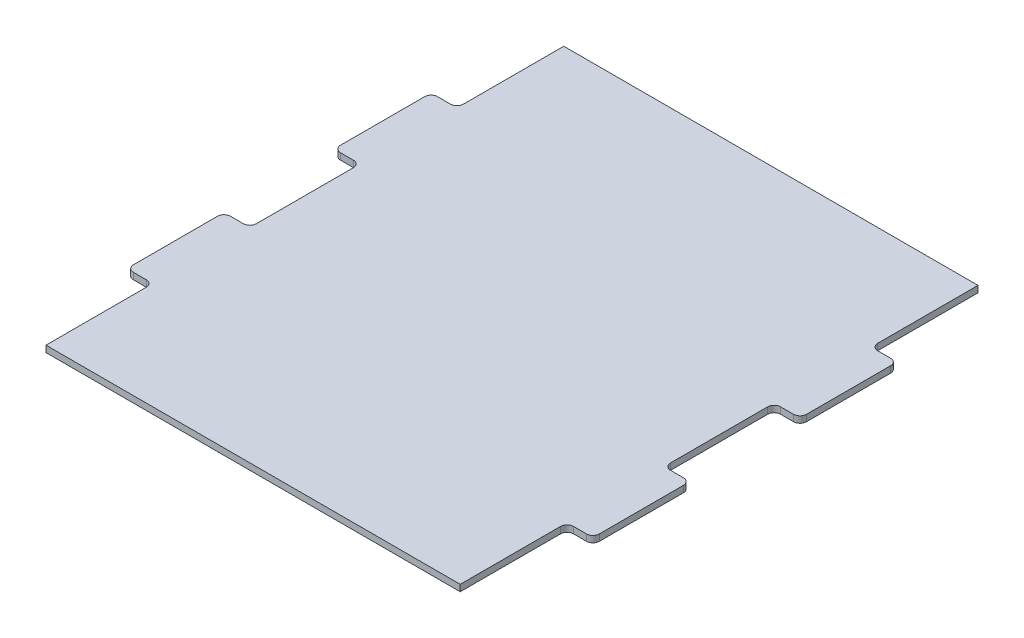
ISO-10303-21;
HEADER;
FILE_DESCRIPTION(('STEP AP214'),'2;1');
FILE_NAME('part.step','',(''),(''),'','','');
FILE_SCHEMA(('AUTOMOTIVE_DESIGN { 1 0 10303 214 1 1 1 1 }'));
ENDSEC;
DATA;
#1=APPLICATION_CONTEXT('core data for automotive mechanical design processes');
#2=APPLICATION_PROTOCOL_DEFINITION('international standard','automotive_design',2000,#1);
#3=PRODUCT_CONTEXT('',#1,'mechanical');
#4=PRODUCT('Part','Part','',(#3));
#5=PRODUCT_RELATED_PRODUCT_CATEGORY('part','',(#4));
#6=PRODUCT_DEFINITION_FORMATION('','',#4);
#7=PRODUCT_DEFINITION_CONTEXT('part definition',#1,'design');
#8=PRODUCT_DEFINITION('design','',#6,#7);
#9=PRODUCT_DEFINITION_SHAPE('','',#8);
#10=(LENGTH_UNIT() NAMED_UNIT(*) SI_UNIT(.MILLI.,.METRE.));
#11=(NAMED_UNIT(*) PLANE_ANGLE_UNIT() SI_UNIT($,.RADIAN.));
#12=(NAMED_UNIT(*) SI_UNIT($,.STERADIAN.) SOLID_ANGLE_UNIT());
#13=UNCERTAINTY_MEASURE_WITH_UNIT(LENGTH_MEASURE(1.E-05),#10,'distance_accuracy_value','');
#14=(GEOMETRIC_REPRESENTATION_CONTEXT(3) GLOBAL_UNCERTAINTY_ASSIGNED_CONTEXT((#13)) GLOBAL_UNIT_ASSIGNED_CONTEXT((#10,
#11,#12)) REPRESENTATION_CONTEXT('',''));
#15=CARTESIAN_POINT('',(0.,0.,0.));
#16=DIRECTION('',(0.,0.,1.));
#17=DIRECTION('',(1.,0.,0.));
#18=AXIS2_PLACEMENT_3D('',#15,#16,#17);
#19=CARTESIAN_POINT('',(0.,3.175,0.));
#20=DIRECTION('',(1.,0.,0.));
#21=DIRECTION('',(0.,0.,-1.));
#22=AXIS2_PLACEMENT_3D('',#19,#20,#21);
#23=PLANE('',#22);
#24=DIRECTION('',(0.,0.,1.));
#25=VECTOR('',#24,1.);
#26=CARTESIAN_POINT('',(0.,3.175,0.));
#27=LINE('',#26,#25);
#28=CARTESIAN_POINT('',(0.,3.175,204.7875));
#29=VERTEX_POINT('',#28);
#30=CARTESIAN_POINT('',(0.,3.175,254.));
#31=VERTEX_POINT('',#30);
#32=EDGE_CURVE('E283',#29,#31,#27,.T.);
#33=ORIENTED_EDGE('',*,*,#32,.F.);
#34=DIRECTION('',(0.,-1.,0.));
#35=VECTOR('',#34,1.);
#36=CARTESIAN_POINT('',(0.,3.175,204.7875));
#37=LINE('',#36,#35);
#38=CARTESIAN_POINT('',(0.,0.,204.7875));
#39=VERTEX_POINT('',#38);
#40=EDGE_CURVE('E375',#29,#39,#37,.T.);
#41=ORIENTED_EDGE('',*,*,#40,.T.);
#42=DIRECTION('',(0.,0.,1.));
#43=VECTOR('',#42,1.);
#44=CARTESIAN_POINT('',(0.,0.,0.));
#45=LINE('',#44,#43);
#46=CARTESIAN_POINT('',(0.,0.,254.));
#47=VERTEX_POINT('',#46);
#48=EDGE_CURVE('E461',#39,#47,#45,.T.);
#49=ORIENTED_EDGE('',*,*,#48,.T.);
#50=DIRECTION('',(0.,-1.,0.));
#51=VECTOR('',#50,1.);
#52=CARTESIAN_POINT('',(0.,3.175,254.));
#53=LINE('',#52,#51);
#54=EDGE_CURVE('E299',#31,#47,#53,.T.);
#55=ORIENTED_EDGE('',*,*,#54,.F.);
#56=EDGE_LOOP('',(#33,#41,#49,#55));
#57=FACE_BOUND('',#56,.T.);
#58=ADVANCED_FACE('F35',(#57),#23,.F.);
#59=CARTESIAN_POINT('',(203.2,3.175,254.));
#60=DIRECTION('',(-1.,0.,0.));
#61=DIRECTION('',(0.,0.,1.));
#62=AXIS2_PLACEMENT_3D('',#59,#60,#61);
#63=PLANE('',#62);
#64=DIRECTION('',(0.,0.,-1.));
#65=VECTOR('',#64,1.);
#66=CARTESIAN_POINT('',(203.2,0.,254.));
#67=LINE('',#66,#65);
#68=CARTESIAN_POINT('',(203.2,0.,254.));
#69=VERTEX_POINT('',#68);
#70=CARTESIAN_POINT('',(203.2,0.,204.7875));
#71=VERTEX_POINT('',#70);
#72=EDGE_CURVE('E293',#69,#71,#67,.T.);
#73=ORIENTED_EDGE('',*,*,#72,.T.);
#74=DIRECTION('',(0.,1.,0.));
#75=VECTOR('',#74,1.);
#76=CARTESIAN_POINT('',(203.2,3.175,204.7875));
#77=LINE('',#76,#75);
#78=CARTESIAN_POINT('',(203.2,3.175,204.7875));
#79=VERTEX_POINT('',#78);
#80=EDGE_CURVE('E298',#71,#79,#77,.T.);
#81=ORIENTED_EDGE('',*,*,#80,.T.);
#82=DIRECTION('',(0.,0.,-1.));
#83=VECTOR('',#82,1.);
#84=CARTESIAN_POINT('',(203.2,3.175,254.));
#85=LINE('',#84,#83);
#86=CARTESIAN_POINT('',(203.2,3.175,254.));
#87=VERTEX_POINT('',#86);
#88=EDGE_CURVE('E474',#87,#79,#85,.T.);
#89=ORIENTED_EDGE('',*,*,#88,.F.);
#90=DIRECTION('',(0.,-1.,0.));
#91=VECTOR('',#90,1.);
#92=CARTESIAN_POINT('',(203.2,3.175,254.));
#93=LINE('',#92,#91);
#94=EDGE_CURVE('E305',#87,#69,#93,.T.);
#95=ORIENTED_EDGE('',*,*,#94,.T.);
#96=EDGE_LOOP('',(#73,#81,#89,#95));
#97=FACE_BOUND('',#96,.T.);
#98=ADVANCED_FACE('F590',(#97),#63,.F.);
#99=CARTESIAN_POINT('',(0.,0.,103.1875));
#100=VERTEX_POINT('',#99);
#101=CARTESIAN_POINT('',(0.,0.,150.8125));
#102=VERTEX_POINT('',#101);
#103=EDGE_CURVE('E459',#100,#102,#45,.T.);
#104=ORIENTED_EDGE('',*,*,#103,.T.);
#105=DIRECTION('',(0.,1.,0.));
#106=VECTOR('',#105,1.);
#107=CARTESIAN_POINT('',(0.,3.175,150.8125));
#108=LINE('',#107,#106);
#109=CARTESIAN_POINT('',(0.,3.175,150.8125));
#110=VERTEX_POINT('',#109);
#111=EDGE_CURVE('E390',#102,#110,#108,.T.);
#112=ORIENTED_EDGE('',*,*,#111,.T.);
#113=CARTESIAN_POINT('',(0.,3.175,103.1875));
#114=VERTEX_POINT('',#113);
#115=EDGE_CURVE('E281',#114,#110,#27,.T.);
#116=ORIENTED_EDGE('',*,*,#115,.F.);
#117=DIRECTION('',(0.,-1.,0.));
#118=VECTOR('',#117,1.);
#119=CARTESIAN_POINT('',(0.,3.175,103.1875));
#120=LINE('',#119,#118);
#121=EDGE_CURVE('E387',#114,#100,#120,.T.);
#122=ORIENTED_EDGE('',*,*,#121,.T.);
#123=EDGE_LOOP('',(#104,#112,#116,#122));
#124=FACE_BOUND('',#123,.T.);
#125=ADVANCED_FACE('F617',(#124),#23,.F.);
#126=CARTESIAN_POINT('',(203.2,3.175,150.8125));
#127=VERTEX_POINT('',#126);
#128=CARTESIAN_POINT('',(203.2,3.175,103.1875));
#129=VERTEX_POINT('',#128);
#130=EDGE_CURVE('E478',#127,#129,#85,.T.);
#131=ORIENTED_EDGE('',*,*,#130,.F.);
#132=DIRECTION('',(0.,-1.,0.));
#133=VECTOR('',#132,1.);
#134=CARTESIAN_POINT('',(203.2,3.175,150.8125));
#135=LINE('',#134,#133);
#136=CARTESIAN_POINT('',(203.2,0.,150.8125));
#137=VERTEX_POINT('',#136);
#138=EDGE_CURVE('E356',#127,#137,#135,.T.);
#139=ORIENTED_EDGE('',*,*,#138,.T.);
#140=CARTESIAN_POINT('',(203.2,0.,103.1875));
#141=VERTEX_POINT('',#140);
#142=EDGE_CURVE('E552',#137,#141,#67,.T.);
#143=ORIENTED_EDGE('',*,*,#142,.T.);
#144=DIRECTION('',(0.,1.,0.));
#145=VECTOR('',#144,1.);
#146=CARTESIAN_POINT('',(203.2,3.175,103.1875));
#147=LINE('',#146,#145);
#148=EDGE_CURVE('E353',#141,#129,#147,.T.);
#149=ORIENTED_EDGE('',*,*,#148,.T.);
#150=EDGE_LOOP('',(#131,#139,#143,#149));
#151=FACE_BOUND('',#150,.T.);
#152=ADVANCED_FACE('F548',(#151),#63,.F.);
#153=CARTESIAN_POINT('',(203.2,3.175,0.));
#154=DIRECTION('',(0.,0.,1.));
#155=DIRECTION('',(1.,0.,0.));
#156=AXIS2_PLACEMENT_3D('',#153,#154,#155);
#157=PLANE('',#156);
#158=DIRECTION('',(-1.,0.,0.));
#159=VECTOR('',#158,1.);
#160=CARTESIAN_POINT('',(203.2,0.,0.));
#161=LINE('',#160,#159);
#162=CARTESIAN_POINT('',(203.2,0.,0.));
#163=VERTEX_POINT('',#162);
#164=CARTESIAN_POINT('',(0.,0.,0.));
#165=VERTEX_POINT('',#164);
#166=EDGE_CURVE('E297',#163,#165,#161,.T.);
#167=ORIENTED_EDGE('',*,*,#166,.T.);
#168=DIRECTION('',(0.,-1.,0.));
#169=VECTOR('',#168,1.);
#170=CARTESIAN_POINT('',(0.,3.175,0.));
#171=LINE('',#170,#169);
#172=CARTESIAN_POINT('',(0.,3.175,0.));
#173=VERTEX_POINT('',#172);
#174=EDGE_CURVE('E275',#173,#165,#171,.T.);
#175=ORIENTED_EDGE('',*,*,#174,.F.);
#176=DIRECTION('',(-1.,0.,0.));
#177=VECTOR('',#176,1.);
#178=CARTESIAN_POINT('',(203.2,3.175,0.));
#179=LINE('',#178,#177);
#180=CARTESIAN_POINT('',(203.2,3.175,0.));
#181=VERTEX_POINT('',#180);
#182=EDGE_CURVE('E285',#181,#173,#179,.T.);
#183=ORIENTED_EDGE('',*,*,#182,.F.);
#184=DIRECTION('',(0.,-1.,0.));
#185=VECTOR('',#184,1.);
#186=CARTESIAN_POINT('',(203.2,3.175,0.));
#187=LINE('',#186,#185);
#188=EDGE_CURVE('E477',#181,#163,#187,.T.);
#189=ORIENTED_EDGE('',*,*,#188,.T.);
#190=EDGE_LOOP('',(#167,#175,#183,#189));
#191=FACE_BOUND('',#190,.T.);
#192=ADVANCED_FACE('F295',(#191),#157,.F.);
#193=CARTESIAN_POINT('',(0.,0.,49.2125));
#194=VERTEX_POINT('',#193);
#195=EDGE_CURVE('E456',#165,#194,#45,.T.);
#196=ORIENTED_EDGE('',*,*,#195,.T.);
#197=DIRECTION('',(0.,1.,0.));
#198=VECTOR('',#197,1.);
#199=CARTESIAN_POINT('',(0.,3.175,49.2125));
#200=LINE('',#199,#198);
#201=CARTESIAN_POINT('',(0.,3.175,49.2125));
#202=VERTEX_POINT('',#201);
#203=EDGE_CURVE('E278',#194,#202,#200,.T.);
#204=ORIENTED_EDGE('',*,*,#203,.T.);
#205=EDGE_CURVE('E270',#173,#202,#27,.T.);
#206=ORIENTED_EDGE('',*,*,#205,.F.);
#207=ORIENTED_EDGE('',*,*,#174,.T.);
#208=EDGE_LOOP('',(#196,#204,#206,#207));
#209=FACE_BOUND('',#208,.T.);
#210=ADVANCED_FACE('F273',(#209),#23,.F.);
#211=CARTESIAN_POINT('',(0.,3.175,254.));
#212=DIRECTION('',(0.,0.,-1.));
#213=DIRECTION('',(-1.,0.,0.));
#214=AXIS2_PLACEMENT_3D('',#211,#212,#213);
#215=PLANE('',#214);
#216=DIRECTION('',(1.,0.,0.));
#217=VECTOR('',#216,1.);
#218=CARTESIAN_POINT('',(0.,0.,254.));
#219=LINE('',#218,#217);
#220=EDGE_CURVE('E458',#47,#69,#219,.T.);
#221=ORIENTED_EDGE('',*,*,#220,.T.);
#222=ORIENTED_EDGE('',*,*,#94,.F.);
#223=DIRECTION('',(1.,0.,0.));
#224=VECTOR('',#223,1.);
#225=CARTESIAN_POINT('',(0.,3.175,254.));
#226=LINE('',#225,#224);
#227=EDGE_CURVE('E280',#31,#87,#226,.T.);
#228=ORIENTED_EDGE('',*,*,#227,.F.);
#229=ORIENTED_EDGE('',*,*,#54,.T.);
#230=EDGE_LOOP('',(#221,#222,#228,#229));
#231=FACE_BOUND('',#230,.T.);
#232=ADVANCED_FACE('F628',(#231),#215,.F.);
#233=CARTESIAN_POINT('',(203.2,3.175,49.2125));
#234=VERTEX_POINT('',#233);
#235=EDGE_CURVE('E289',#234,#181,#85,.T.);
#236=ORIENTED_EDGE('',*,*,#235,.F.);
#237=DIRECTION('',(0.,-1.,0.));
#238=VECTOR('',#237,1.);
#239=CARTESIAN_POINT('',(203.2,3.175,49.2125));
#240=LINE('',#239,#238);
#241=CARTESIAN_POINT('',(203.2,0.,49.2125));
#242=VERTEX_POINT('',#241);
#243=EDGE_CURVE('E372',#234,#242,#240,.T.);
#244=ORIENTED_EDGE('',*,*,#243,.T.);
#245=EDGE_CURVE('E462',#242,#163,#67,.T.);
#246=ORIENTED_EDGE('',*,*,#245,.T.);
#247=ORIENTED_EDGE('',*,*,#188,.F.);
#248=EDGE_LOOP('',(#236,#244,#246,#247));
#249=FACE_BOUND('',#248,.T.);
#250=ADVANCED_FACE('F581',(#249),#63,.F.);
#251=CARTESIAN_POINT('',(0.,3.175,0.));
#252=DIRECTION('',(0.,1.,0.));
#253=DIRECTION('',(0.,0.,1.));
#254=AXIS2_PLACEMENT_3D('',#251,#252,#253);
#255=PLANE('',#254);
#256=DIRECTION('',(1.,0.,0.));
#257=VECTOR('',#256,1.);
#258=CARTESIAN_POINT('',(-12.7,3.175,201.6125));
#259=LINE('',#258,#257);
#260=CARTESIAN_POINT('',(206.375,3.175,201.6125));
#261=VERTEX_POINT('',#260);
#262=CARTESIAN_POINT('',(212.725,3.175,201.6125));
#263=VERTEX_POINT('',#262);
#264=EDGE_CURVE('E503',#261,#263,#259,.T.);
#265=ORIENTED_EDGE('',*,*,#264,.T.);
#266=CARTESIAN_POINT('',(212.725,3.175,198.4375));
#267=DIRECTION('',(0.,1.,0.));
#268=DIRECTION('',(0.,0.,1.));
#269=AXIS2_PLACEMENT_3D('',#266,#267,#268);
#270=CIRCLE('',#269,3.175);
#271=CARTESIAN_POINT('',(215.9,3.175,198.4375));
#272=VERTEX_POINT('',#271);
#273=EDGE_CURVE('E327',#263,#272,#270,.T.);
#274=ORIENTED_EDGE('',*,*,#273,.T.);
#275=DIRECTION('',(0.,0.,-1.));
#276=VECTOR('',#275,1.);
#277=CARTESIAN_POINT('',(215.9,3.175,201.6125));
#278=LINE('',#277,#276);
#279=CARTESIAN_POINT('',(215.9,3.175,157.1625));
#280=VERTEX_POINT('',#279);
#281=EDGE_CURVE('E511',#272,#280,#278,.T.);
#282=ORIENTED_EDGE('',*,*,#281,.T.);
#283=CARTESIAN_POINT('',(212.725,3.175,157.1625));
#284=DIRECTION('',(0.,1.,0.));
#285=DIRECTION('',(0.,0.,1.));
#286=AXIS2_PLACEMENT_3D('',#283,#284,#285);
#287=CIRCLE('',#286,3.175);
#288=CARTESIAN_POINT('',(212.725,3.175,153.9875));
#289=VERTEX_POINT('',#288);
#290=EDGE_CURVE('E325',#280,#289,#287,.T.);
#291=ORIENTED_EDGE('',*,*,#290,.T.);
#292=DIRECTION('',(-1.,0.,0.));
#293=VECTOR('',#292,1.);
#294=CARTESIAN_POINT('',(-12.7,3.175,153.9875));
#295=LINE('',#294,#293);
#296=CARTESIAN_POINT('',(206.375,3.175,153.9875));
#297=VERTEX_POINT('',#296);
#298=EDGE_CURVE('E507',#289,#297,#295,.T.);
#299=ORIENTED_EDGE('',*,*,#298,.T.);
#300=CARTESIAN_POINT('',(206.375,3.175,150.8125));
#301=DIRECTION('',(0.,1.,0.));
#302=DIRECTION('',(0.,0.,1.));
#303=AXIS2_PLACEMENT_3D('',#300,#301,#302);
#304=CIRCLE('',#303,3.175);
#305=EDGE_CURVE('E419',#297,#127,#304,.F.);
#306=ORIENTED_EDGE('',*,*,#305,.T.);
#307=ORIENTED_EDGE('',*,*,#130,.T.);
#308=CARTESIAN_POINT('',(206.375,3.175,103.1875));
#309=DIRECTION('',(0.,1.,0.));
#310=DIRECTION('',(0.,0.,1.));
#311=AXIS2_PLACEMENT_3D('',#308,#309,#310);
#312=CIRCLE('',#311,3.175);
#313=CARTESIAN_POINT('',(206.375,3.175,100.0125));
#314=VERTEX_POINT('',#313);
#315=EDGE_CURVE('E421',#129,#314,#312,.F.);
#316=ORIENTED_EDGE('',*,*,#315,.T.);
#317=DIRECTION('',(1.,0.,0.));
#318=VECTOR('',#317,1.);
#319=CARTESIAN_POINT('',(-12.7,3.175,100.0125));
#320=LINE('',#319,#318);
#321=CARTESIAN_POINT('',(212.725,3.175,100.0125));
#322=VERTEX_POINT('',#321);
#323=EDGE_CURVE('E484',#314,#322,#320,.T.);
#324=ORIENTED_EDGE('',*,*,#323,.T.);
#325=CARTESIAN_POINT('',(212.725,3.175,96.8375));
#326=DIRECTION('',(0.,1.,0.));
#327=DIRECTION('',(0.,0.,1.));
#328=AXIS2_PLACEMENT_3D('',#325,#326,#327);
#329=CIRCLE('',#328,3.175);
#330=CARTESIAN_POINT('',(215.9,3.175,96.8375));
#331=VERTEX_POINT('',#330);
#332=EDGE_CURVE('E323',#322,#331,#329,.T.);
#333=ORIENTED_EDGE('',*,*,#332,.T.);
#334=DIRECTION('',(0.,0.,-1.));
#335=VECTOR('',#334,1.);
#336=CARTESIAN_POINT('',(215.9,3.175,100.0125));
#337=LINE('',#336,#335);
#338=CARTESIAN_POINT('',(215.9,3.175,55.5625));
#339=VERTEX_POINT('',#338);
#340=EDGE_CURVE('E451',#331,#339,#337,.T.);
#341=ORIENTED_EDGE('',*,*,#340,.T.);
#342=CARTESIAN_POINT('',(212.725,3.175,55.5625));
#343=DIRECTION('',(0.,1.,0.));
#344=DIRECTION('',(0.,0.,1.));
#345=AXIS2_PLACEMENT_3D('',#342,#343,#344);
#346=CIRCLE('',#345,3.175);
#347=CARTESIAN_POINT('',(212.725,3.175,52.3875));
#348=VERTEX_POINT('',#347);
#349=EDGE_CURVE('E321',#339,#348,#346,.T.);
#350=ORIENTED_EDGE('',*,*,#349,.T.);
#351=DIRECTION('',(-1.,0.,0.));
#352=VECTOR('',#351,1.);
#353=CARTESIAN_POINT('',(-12.7,3.175,52.3875));
#354=LINE('',#353,#352);
#355=CARTESIAN_POINT('',(206.375,3.175,52.3875));
#356=VERTEX_POINT('',#355);
#357=EDGE_CURVE('E450',#348,#356,#354,.T.);
#358=ORIENTED_EDGE('',*,*,#357,.T.);
#359=CARTESIAN_POINT('',(206.375,3.175,49.2125));
#360=DIRECTION('',(0.,1.,0.));
#361=DIRECTION('',(0.,0.,1.));
#362=AXIS2_PLACEMENT_3D('',#359,#360,#361);
#363=CIRCLE('',#362,3.175);
#364=EDGE_CURVE('E427',#356,#234,#363,.F.);
#365=ORIENTED_EDGE('',*,*,#364,.T.);
#366=ORIENTED_EDGE('',*,*,#235,.T.);
#367=ORIENTED_EDGE('',*,*,#182,.T.);
#368=ORIENTED_EDGE('',*,*,#205,.T.);
#369=CARTESIAN_POINT('',(-3.17499999999999,3.175,49.2125));
#370=DIRECTION('',(0.,1.,0.));
#371=DIRECTION('',(0.,0.,1.));
#372=AXIS2_PLACEMENT_3D('',#369,#370,#371);
#373=CIRCLE('',#372,3.175);
#374=CARTESIAN_POINT('',(-3.17499999999999,3.175,52.3875));
#375=VERTEX_POINT('',#374);
#376=EDGE_CURVE('E43',#202,#375,#373,.F.);
#377=ORIENTED_EDGE('',*,*,#376,.T.);
#378=CARTESIAN_POINT('',(-9.52500000000002,3.175,52.3875));
#379=VERTEX_POINT('',#378);
#380=EDGE_CURVE('E442',#375,#379,#354,.T.);
#381=ORIENTED_EDGE('',*,*,#380,.T.);
#382=CARTESIAN_POINT('',(-9.52500000000002,3.175,55.5625));
#383=DIRECTION('',(0.,1.,0.));
#384=DIRECTION('',(0.,0.,1.));
#385=AXIS2_PLACEMENT_3D('',#382,#383,#384);
#386=CIRCLE('',#385,3.175);
#387=CARTESIAN_POINT('',(-12.7,3.175,55.5625));
#388=VERTEX_POINT('',#387);
#389=EDGE_CURVE('E313',#379,#388,#386,.T.);
#390=ORIENTED_EDGE('',*,*,#389,.T.);
#391=DIRECTION('',(0.,0.,1.));
#392=VECTOR('',#391,1.);
#393=CARTESIAN_POINT('',(-12.7,3.175,100.0125));
#394=LINE('',#393,#392);
#395=CARTESIAN_POINT('',(-12.7,3.175,96.8375));
#396=VERTEX_POINT('',#395);
#397=EDGE_CURVE('E485',#388,#396,#394,.T.);
#398=ORIENTED_EDGE('',*,*,#397,.T.);
#399=CARTESIAN_POINT('',(-9.52500000000002,3.175,96.8375));
#400=DIRECTION('',(0.,1.,0.));
#401=DIRECTION('',(0.,0.,1.));
#402=AXIS2_PLACEMENT_3D('',#399,#400,#401);
#403=CIRCLE('',#402,3.175);
#404=CARTESIAN_POINT('',(-9.52500000000002,3.175,100.0125));
#405=VERTEX_POINT('',#404);
#406=EDGE_CURVE('E315',#396,#405,#403,.T.);
#407=ORIENTED_EDGE('',*,*,#406,.T.);
#408=CARTESIAN_POINT('',(-3.17499999999999,3.175,100.0125));
#409=VERTEX_POINT('',#408);
#410=EDGE_CURVE('E480',#405,#409,#320,.T.);
#411=ORIENTED_EDGE('',*,*,#410,.T.);
#412=CARTESIAN_POINT('',(-3.17499999999999,3.175,103.1875));
#413=DIRECTION('',(0.,1.,0.));
#414=DIRECTION('',(0.,0.,1.));
#415=AXIS2_PLACEMENT_3D('',#412,#413,#414);
#416=CIRCLE('',#415,3.175);
#417=EDGE_CURVE('E439',#409,#114,#416,.F.);
#418=ORIENTED_EDGE('',*,*,#417,.T.);
#419=ORIENTED_EDGE('',*,*,#115,.T.);
#420=CARTESIAN_POINT('',(-3.17499999999998,3.175,150.8125));
#421=DIRECTION('',(0.,1.,0.));
#422=DIRECTION('',(0.,0.,1.));
#423=AXIS2_PLACEMENT_3D('',#420,#421,#422);
#424=CIRCLE('',#423,3.175);
#425=CARTESIAN_POINT('',(-3.17499999999998,3.175,153.9875));
#426=VERTEX_POINT('',#425);
#427=EDGE_CURVE('E433',#110,#426,#424,.F.);
#428=ORIENTED_EDGE('',*,*,#427,.T.);
#429=CARTESIAN_POINT('',(-9.525,3.175,153.9875));
#430=VERTEX_POINT('',#429);
#431=EDGE_CURVE('E510',#426,#430,#295,.T.);
#432=ORIENTED_EDGE('',*,*,#431,.T.);
#433=CARTESIAN_POINT('',(-9.525,3.175,157.1625));
#434=DIRECTION('',(0.,1.,0.));
#435=DIRECTION('',(0.,0.,1.));
#436=AXIS2_PLACEMENT_3D('',#433,#434,#435);
#437=CIRCLE('',#436,3.175);
#438=CARTESIAN_POINT('',(-12.7,3.175,157.1625));
#439=VERTEX_POINT('',#438);
#440=EDGE_CURVE('E317',#430,#439,#437,.T.);
#441=ORIENTED_EDGE('',*,*,#440,.T.);
#442=DIRECTION('',(0.,0.,1.));
#443=VECTOR('',#442,1.);
#444=CARTESIAN_POINT('',(-12.7,3.175,201.6125));
#445=LINE('',#444,#443);
#446=CARTESIAN_POINT('',(-12.7,3.175,198.4375));
#447=VERTEX_POINT('',#446);
#448=EDGE_CURVE('E504',#439,#447,#445,.T.);
#449=ORIENTED_EDGE('',*,*,#448,.T.);
#450=CARTESIAN_POINT('',(-9.525,3.175,198.4375));
#451=DIRECTION('',(0.,1.,0.));
#452=DIRECTION('',(0.,0.,1.));
#453=AXIS2_PLACEMENT_3D('',#450,#451,#452);
#454=CIRCLE('',#453,3.175);
#455=CARTESIAN_POINT('',(-9.525,3.175,201.6125));
#456=VERTEX_POINT('',#455);
#457=EDGE_CURVE('E319',#447,#456,#454,.T.);
#458=ORIENTED_EDGE('',*,*,#457,.T.);
#459=CARTESIAN_POINT('',(-3.17499999999997,3.175,201.6125));
#460=VERTEX_POINT('',#459);
#461=EDGE_CURVE('E499',#456,#460,#259,.T.);
#462=ORIENTED_EDGE('',*,*,#461,.T.);
#463=CARTESIAN_POINT('',(-3.17499999999997,3.175,204.7875));
#464=DIRECTION('',(0.,1.,0.));
#465=DIRECTION('',(0.,0.,1.));
#466=AXIS2_PLACEMENT_3D('',#463,#464,#465);
#467=CIRCLE('',#466,3.175);
#468=EDGE_CURVE('E431',#460,#29,#467,.F.);
#469=ORIENTED_EDGE('',*,*,#468,.T.);
#470=ORIENTED_EDGE('',*,*,#32,.T.);
#471=ORIENTED_EDGE('',*,*,#227,.T.);
#472=ORIENTED_EDGE('',*,*,#88,.T.);
#473=CARTESIAN_POINT('',(206.375,3.175,204.7875));
#474=DIRECTION('',(0.,1.,0.));
#475=DIRECTION('',(0.,0.,1.));
#476=AXIS2_PLACEMENT_3D('',#473,#474,#475);
#477=CIRCLE('',#476,3.175);
#478=EDGE_CURVE('E413',#79,#261,#477,.F.);
#479=ORIENTED_EDGE('',*,*,#478,.T.);
#480=EDGE_LOOP('',(#265,#274,#282,#291,#299,#306,#307,#316,#324,#333,#341,#350,#358,#365,#366,
#367,#368,#377,#381,#390,#398,#407,#411,#418,#419,#428,#432,#441,#449,#458,#462,#469,#470,#471,
#472,#479));
#481=FACE_BOUND('',#480,.T.);
#482=ADVANCED_FACE('F287',(#481),#255,.T.);
#483=CARTESIAN_POINT('',(0.,0.,0.));
#484=DIRECTION('',(0.,1.,0.));
#485=DIRECTION('',(0.,0.,1.));
#486=AXIS2_PLACEMENT_3D('',#483,#484,#485);
#487=PLANE('',#486);
#488=DIRECTION('',(0.,0.,-1.));
#489=VECTOR('',#488,1.);
#490=CARTESIAN_POINT('',(215.9,0.,201.6125));
#491=LINE('',#490,#489);
#492=CARTESIAN_POINT('',(215.9,0.,198.4375));
#493=VERTEX_POINT('',#492);
#494=CARTESIAN_POINT('',(215.9,0.,157.1625));
#495=VERTEX_POINT('',#494);
#496=EDGE_CURVE('E502',#493,#495,#491,.T.);
#497=ORIENTED_EDGE('',*,*,#496,.F.);
#498=CARTESIAN_POINT('',(212.725,0.,198.4375));
#499=DIRECTION('',(0.,1.,0.));
#500=DIRECTION('',(0.,0.,1.));
#501=AXIS2_PLACEMENT_3D('',#498,#499,#500);
#502=CIRCLE('',#501,3.175);
#503=CARTESIAN_POINT('',(212.725,0.,201.6125));
#504=VERTEX_POINT('',#503);
#505=EDGE_CURVE('E347',#493,#504,#502,.F.);
#506=ORIENTED_EDGE('',*,*,#505,.T.);
#507=DIRECTION('',(1.,0.,0.));
#508=VECTOR('',#507,1.);
#509=CARTESIAN_POINT('',(-12.7,0.,201.6125));
#510=LINE('',#509,#508);
#511=CARTESIAN_POINT('',(206.375,0.,201.6125));
#512=VERTEX_POINT('',#511);
#513=EDGE_CURVE('E516',#512,#504,#510,.T.);
#514=ORIENTED_EDGE('',*,*,#513,.F.);
#515=CARTESIAN_POINT('',(206.375,0.,204.7875));
#516=DIRECTION('',(0.,1.,0.));
#517=DIRECTION('',(0.,0.,1.));
#518=AXIS2_PLACEMENT_3D('',#515,#516,#517);
#519=CIRCLE('',#518,3.175);
#520=EDGE_CURVE('E415',#512,#71,#519,.T.);
#521=ORIENTED_EDGE('',*,*,#520,.T.);
#522=ORIENTED_EDGE('',*,*,#72,.F.);
#523=ORIENTED_EDGE('',*,*,#220,.F.);
#524=ORIENTED_EDGE('',*,*,#48,.F.);
#525=CARTESIAN_POINT('',(-3.17499999999997,0.,204.7875));
#526=DIRECTION('',(0.,1.,0.));
#527=DIRECTION('',(0.,0.,1.));
#528=AXIS2_PLACEMENT_3D('',#525,#526,#527);
#529=CIRCLE('',#528,3.175);
#530=CARTESIAN_POINT('',(-3.17499999999997,0.,201.6125));
#531=VERTEX_POINT('',#530);
#532=EDGE_CURVE('E429',#39,#531,#529,.T.);
#533=ORIENTED_EDGE('',*,*,#532,.T.);
#534=CARTESIAN_POINT('',(-9.525,0.,201.6125));
#535=VERTEX_POINT('',#534);
#536=EDGE_CURVE('E489',#535,#531,#510,.T.);
#537=ORIENTED_EDGE('',*,*,#536,.F.);
#538=CARTESIAN_POINT('',(-9.525,0.,198.4375));
#539=DIRECTION('',(0.,1.,0.));
#540=DIRECTION('',(0.,0.,1.));
#541=AXIS2_PLACEMENT_3D('',#538,#539,#540);
#542=CIRCLE('',#541,3.175);
#543=CARTESIAN_POINT('',(-12.7,0.,198.4375));
#544=VERTEX_POINT('',#543);
#545=EDGE_CURVE('E340',#535,#544,#542,.F.);
#546=ORIENTED_EDGE('',*,*,#545,.T.);
#547=DIRECTION('',(0.,0.,1.));
#548=VECTOR('',#547,1.);
#549=CARTESIAN_POINT('',(-12.7,0.,201.6125));
#550=LINE('',#549,#548);
#551=CARTESIAN_POINT('',(-12.7,0.,157.1625));
#552=VERTEX_POINT('',#551);
#553=EDGE_CURVE('E517',#552,#544,#550,.T.);
#554=ORIENTED_EDGE('',*,*,#553,.F.);
#555=CARTESIAN_POINT('',(-9.525,0.,157.1625));
#556=DIRECTION('',(0.,1.,0.));
#557=DIRECTION('',(0.,0.,1.));
#558=AXIS2_PLACEMENT_3D('',#555,#556,#557);
#559=CIRCLE('',#558,3.175);
#560=CARTESIAN_POINT('',(-9.525,0.,153.9875));
#561=VERTEX_POINT('',#560);
#562=EDGE_CURVE('E338',#552,#561,#559,.F.);
#563=ORIENTED_EDGE('',*,*,#562,.T.);
#564=DIRECTION('',(-1.,0.,0.));
#565=VECTOR('',#564,1.);
#566=CARTESIAN_POINT('',(-12.7,0.,153.9875));
#567=LINE('',#566,#565);
#568=CARTESIAN_POINT('',(-3.17499999999998,0.,153.9875));
#569=VERTEX_POINT('',#568);
#570=EDGE_CURVE('E521',#569,#561,#567,.T.);
#571=ORIENTED_EDGE('',*,*,#570,.F.);
#572=CARTESIAN_POINT('',(-3.17499999999998,0.,150.8125));
#573=DIRECTION('',(0.,1.,0.));
#574=DIRECTION('',(0.,0.,1.));
#575=AXIS2_PLACEMENT_3D('',#572,#573,#574);
#576=CIRCLE('',#575,3.175);
#577=EDGE_CURVE('E435',#569,#102,#576,.T.);
#578=ORIENTED_EDGE('',*,*,#577,.T.);
#579=ORIENTED_EDGE('',*,*,#103,.F.);
#580=CARTESIAN_POINT('',(-3.17499999999999,0.,103.1875));
#581=DIRECTION('',(0.,1.,0.));
#582=DIRECTION('',(0.,0.,1.));
#583=AXIS2_PLACEMENT_3D('',#580,#581,#582);
#584=CIRCLE('',#583,3.175);
#585=CARTESIAN_POINT('',(-3.17499999999999,0.,100.0125));
#586=VERTEX_POINT('',#585);
#587=EDGE_CURVE('E437',#100,#586,#584,.T.);
#588=ORIENTED_EDGE('',*,*,#587,.T.);
#589=DIRECTION('',(1.,0.,0.));
#590=VECTOR('',#589,1.);
#591=CARTESIAN_POINT('',(-12.7,0.,100.0125));
#592=LINE('',#591,#590);
#593=CARTESIAN_POINT('',(-9.52500000000002,0.,100.0125));
#594=VERTEX_POINT('',#593);
#595=EDGE_CURVE('E469',#594,#586,#592,.T.);
#596=ORIENTED_EDGE('',*,*,#595,.F.);
#597=CARTESIAN_POINT('',(-9.52500000000002,0.,96.8375));
#598=DIRECTION('',(0.,1.,0.));
#599=DIRECTION('',(0.,0.,1.));
#600=AXIS2_PLACEMENT_3D('',#597,#598,#599);
#601=CIRCLE('',#600,3.175);
#602=CARTESIAN_POINT('',(-12.7,0.,96.8375));
#603=VERTEX_POINT('',#602);
#604=EDGE_CURVE('E336',#594,#603,#601,.F.);
#605=ORIENTED_EDGE('',*,*,#604,.T.);
#606=DIRECTION('',(0.,0.,1.));
#607=VECTOR('',#606,1.);
#608=CARTESIAN_POINT('',(-12.7,0.,100.0125));
#609=LINE('',#608,#607);
#610=CARTESIAN_POINT('',(-12.7,0.,55.5625));
#611=VERTEX_POINT('',#610);
#612=EDGE_CURVE('E491',#611,#603,#609,.T.);
#613=ORIENTED_EDGE('',*,*,#612,.F.);
#614=CARTESIAN_POINT('',(-9.52500000000002,0.,55.5625));
#615=DIRECTION('',(0.,1.,0.));
#616=DIRECTION('',(0.,0.,1.));
#617=AXIS2_PLACEMENT_3D('',#614,#615,#616);
#618=CIRCLE('',#617,3.175);
#619=CARTESIAN_POINT('',(-9.52500000000002,0.,52.3875));
#620=VERTEX_POINT('',#619);
#621=EDGE_CURVE('E334',#611,#620,#618,.F.);
#622=ORIENTED_EDGE('',*,*,#621,.T.);
#623=DIRECTION('',(-1.,0.,0.));
#624=VECTOR('',#623,1.);
#625=CARTESIAN_POINT('',(-12.7,0.,52.3875));
#626=LINE('',#625,#624);
#627=CARTESIAN_POINT('',(-3.17499999999999,0.,52.3875));
#628=VERTEX_POINT('',#627);
#629=EDGE_CURVE('E457',#628,#620,#626,.T.);
#630=ORIENTED_EDGE('',*,*,#629,.F.);
#631=CARTESIAN_POINT('',(-3.17499999999999,0.,49.2125));
#632=DIRECTION('',(0.,1.,0.));
#633=DIRECTION('',(0.,0.,1.));
#634=AXIS2_PLACEMENT_3D('',#631,#632,#633);
#635=CIRCLE('',#634,3.175);
#636=EDGE_CURVE('E11',#628,#194,#635,.T.);
#637=ORIENTED_EDGE('',*,*,#636,.T.);
#638=ORIENTED_EDGE('',*,*,#195,.F.);
#639=ORIENTED_EDGE('',*,*,#166,.F.);
#640=ORIENTED_EDGE('',*,*,#245,.F.);
#641=CARTESIAN_POINT('',(206.375,0.,49.2125));
#642=DIRECTION('',(0.,1.,0.));
#643=DIRECTION('',(0.,0.,1.));
#644=AXIS2_PLACEMENT_3D('',#641,#642,#643);
#645=CIRCLE('',#644,3.175);
#646=CARTESIAN_POINT('',(206.375,0.,52.3875));
#647=VERTEX_POINT('',#646);
#648=EDGE_CURVE('E425',#242,#647,#645,.T.);
#649=ORIENTED_EDGE('',*,*,#648,.T.);
#650=CARTESIAN_POINT('',(212.725,0.,52.3875));
#651=VERTEX_POINT('',#650);
#652=EDGE_CURVE('E494',#651,#647,#626,.T.);
#653=ORIENTED_EDGE('',*,*,#652,.F.);
#654=CARTESIAN_POINT('',(212.725,0.,55.5625));
#655=DIRECTION('',(0.,1.,0.));
#656=DIRECTION('',(0.,0.,1.));
#657=AXIS2_PLACEMENT_3D('',#654,#655,#656);
#658=CIRCLE('',#657,3.175);
#659=CARTESIAN_POINT('',(215.9,0.,55.5625));
#660=VERTEX_POINT('',#659);
#661=EDGE_CURVE('E342',#651,#660,#658,.F.);
#662=ORIENTED_EDGE('',*,*,#661,.T.);
#663=DIRECTION('',(0.,0.,-1.));
#664=VECTOR('',#663,1.);
#665=CARTESIAN_POINT('',(215.9,0.,100.0125));
#666=LINE('',#665,#664);
#667=CARTESIAN_POINT('',(215.9,0.,96.8375));
#668=VERTEX_POINT('',#667);
#669=EDGE_CURVE('E483',#668,#660,#666,.T.);
#670=ORIENTED_EDGE('',*,*,#669,.F.);
#671=CARTESIAN_POINT('',(212.725,0.,96.8375));
#672=DIRECTION('',(0.,1.,0.));
#673=DIRECTION('',(0.,0.,1.));
#674=AXIS2_PLACEMENT_3D('',#671,#672,#673);
#675=CIRCLE('',#674,3.175);
#676=CARTESIAN_POINT('',(212.725,0.,100.0125));
#677=VERTEX_POINT('',#676);
#678=EDGE_CURVE('E50',#668,#677,#675,.F.);
#679=ORIENTED_EDGE('',*,*,#678,.T.);
#680=CARTESIAN_POINT('',(206.375,0.,100.0125));
#681=VERTEX_POINT('',#680);
#682=EDGE_CURVE('E471',#681,#677,#592,.T.);
#683=ORIENTED_EDGE('',*,*,#682,.F.);
#684=CARTESIAN_POINT('',(206.375,0.,103.1875));
#685=DIRECTION('',(0.,1.,0.));
#686=DIRECTION('',(0.,0.,1.));
#687=AXIS2_PLACEMENT_3D('',#684,#685,#686);
#688=CIRCLE('',#687,3.175);
#689=EDGE_CURVE('E423',#681,#141,#688,.T.);
#690=ORIENTED_EDGE('',*,*,#689,.T.);
#691=ORIENTED_EDGE('',*,*,#142,.F.);
#692=CARTESIAN_POINT('',(206.375,0.,150.8125));
#693=DIRECTION('',(0.,1.,0.));
#694=DIRECTION('',(0.,0.,1.));
#695=AXIS2_PLACEMENT_3D('',#692,#693,#694);
#696=CIRCLE('',#695,3.175);
#697=CARTESIAN_POINT('',(206.375,0.,153.9875));
#698=VERTEX_POINT('',#697);
#699=EDGE_CURVE('E417',#137,#698,#696,.T.);
#700=ORIENTED_EDGE('',*,*,#699,.T.);
#701=CARTESIAN_POINT('',(212.725,0.,153.9875));
#702=VERTEX_POINT('',#701);
#703=EDGE_CURVE('E520',#702,#698,#567,.T.);
#704=ORIENTED_EDGE('',*,*,#703,.F.);
#705=CARTESIAN_POINT('',(212.725,0.,157.1625));
#706=DIRECTION('',(0.,1.,0.));
#707=DIRECTION('',(0.,0.,1.));
#708=AXIS2_PLACEMENT_3D('',#705,#706,#707);
#709=CIRCLE('',#708,3.175);
#710=EDGE_CURVE('E345',#702,#495,#709,.F.);
#711=ORIENTED_EDGE('',*,*,#710,.T.);
#712=EDGE_LOOP('',(#497,#506,#514,#521,#522,#523,#524,#533,#537,#546,#554,#563,#571,#578,#579,
#588,#596,#605,#613,#622,#630,#637,#638,#639,#640,#649,#653,#662,#670,#679,#683,#690,#691,#700,
#704,#711));
#713=FACE_BOUND('',#712,.T.);
#714=ADVANCED_FACE('F455',(#713),#487,.F.);
#715=CARTESIAN_POINT('',(215.9,0.,100.0125));
#716=DIRECTION('',(1.,0.,0.));
#717=DIRECTION('',(0.,0.,-1.));
#718=AXIS2_PLACEMENT_3D('',#715,#716,#717);
#719=PLANE('',#718);
#720=ORIENTED_EDGE('',*,*,#340,.F.);
#721=DIRECTION('',(0.,1.,0.));
#722=VECTOR('',#721,1.);
#723=CARTESIAN_POINT('',(215.9,0.,96.8375));
#724=LINE('',#723,#722);
#725=EDGE_CURVE('E366',#331,#668,#724,.F.);
#726=ORIENTED_EDGE('',*,*,#725,.T.);
#727=ORIENTED_EDGE('',*,*,#669,.T.);
#728=DIRECTION('',(0.,1.,0.));
#729=VECTOR('',#728,1.);
#730=CARTESIAN_POINT('',(215.9,0.,55.5625));
#731=LINE('',#730,#729);
#732=EDGE_CURVE('E363',#660,#339,#731,.T.);
#733=ORIENTED_EDGE('',*,*,#732,.T.);
#734=EDGE_LOOP('',(#720,#726,#727,#733));
#735=FACE_BOUND('',#734,.T.);
#736=ADVANCED_FACE('F564',(#735),#719,.T.);
#737=CARTESIAN_POINT('',(-12.7,0.,52.3875));
#738=DIRECTION('',(0.,0.,-1.));
#739=DIRECTION('',(-1.,0.,0.));
#740=AXIS2_PLACEMENT_3D('',#737,#738,#739);
#741=PLANE('',#740);
#742=ORIENTED_EDGE('',*,*,#357,.F.);
#743=DIRECTION('',(0.,1.,0.));
#744=VECTOR('',#743,1.);
#745=CARTESIAN_POINT('',(212.725,0.,52.3875));
#746=LINE('',#745,#744);
#747=EDGE_CURVE('E370',#348,#651,#746,.F.);
#748=ORIENTED_EDGE('',*,*,#747,.T.);
#749=ORIENTED_EDGE('',*,*,#652,.T.);
#750=DIRECTION('',(0.,-1.,0.));
#751=VECTOR('',#750,1.);
#752=CARTESIAN_POINT('',(206.375,0.,52.3875));
#753=LINE('',#752,#751);
#754=EDGE_CURVE('E368',#647,#356,#753,.F.);
#755=ORIENTED_EDGE('',*,*,#754,.T.);
#756=EDGE_LOOP('',(#742,#748,#749,#755));
#757=FACE_BOUND('',#756,.T.);
#758=ADVANCED_FACE('F574',(#757),#741,.T.);
#759=CARTESIAN_POINT('',(-12.7,0.,100.0125));
#760=DIRECTION('',(0.,0.,1.));
#761=DIRECTION('',(1.,0.,0.));
#762=AXIS2_PLACEMENT_3D('',#759,#760,#761);
#763=PLANE('',#762);
#764=ORIENTED_EDGE('',*,*,#323,.F.);
#765=DIRECTION('',(0.,1.,0.));
#766=VECTOR('',#765,1.);
#767=CARTESIAN_POINT('',(206.375,0.,100.0125));
#768=LINE('',#767,#766);
#769=EDGE_CURVE('E57',#314,#681,#768,.F.);
#770=ORIENTED_EDGE('',*,*,#769,.T.);
#771=ORIENTED_EDGE('',*,*,#682,.T.);
#772=DIRECTION('',(0.,1.,0.));
#773=VECTOR('',#772,1.);
#774=CARTESIAN_POINT('',(212.725,0.,100.0125));
#775=LINE('',#774,#773);
#776=EDGE_CURVE('E359',#677,#322,#775,.T.);
#777=ORIENTED_EDGE('',*,*,#776,.T.);
#778=EDGE_LOOP('',(#764,#770,#771,#777));
#779=FACE_BOUND('',#778,.T.);
#780=ADVANCED_FACE('F557',(#779),#763,.T.);
#781=ORIENTED_EDGE('',*,*,#595,.T.);
#782=DIRECTION('',(0.,-1.,0.));
#783=VECTOR('',#782,1.);
#784=CARTESIAN_POINT('',(-3.17499999999999,0.,100.0125));
#785=LINE('',#784,#783);
#786=EDGE_CURVE('E400',#586,#409,#785,.F.);
#787=ORIENTED_EDGE('',*,*,#786,.T.);
#788=ORIENTED_EDGE('',*,*,#410,.F.);
#789=DIRECTION('',(0.,1.,0.));
#790=VECTOR('',#789,1.);
#791=CARTESIAN_POINT('',(-9.52500000000002,0.,100.0125));
#792=LINE('',#791,#790);
#793=EDGE_CURVE('E398',#405,#594,#792,.F.);
#794=ORIENTED_EDGE('',*,*,#793,.T.);
#795=EDGE_LOOP('',(#781,#787,#788,#794));
#796=FACE_BOUND('',#795,.T.);
#797=ADVANCED_FACE('F654',(#796),#763,.T.);
#798=ORIENTED_EDGE('',*,*,#629,.T.);
#799=DIRECTION('',(0.,1.,0.));
#800=VECTOR('',#799,1.);
#801=CARTESIAN_POINT('',(-9.52500000000002,0.,52.3875));
#802=LINE('',#801,#800);
#803=EDGE_CURVE('E409',#620,#379,#802,.T.);
#804=ORIENTED_EDGE('',*,*,#803,.T.);
#805=ORIENTED_EDGE('',*,*,#380,.F.);
#806=DIRECTION('',(0.,1.,0.));
#807=VECTOR('',#806,1.);
#808=CARTESIAN_POINT('',(-3.17499999999999,0.,52.3875));
#809=LINE('',#808,#807);
#810=EDGE_CURVE('E407',#375,#628,#809,.F.);
#811=ORIENTED_EDGE('',*,*,#810,.T.);
#812=EDGE_LOOP('',(#798,#804,#805,#811));
#813=FACE_BOUND('',#812,.T.);
#814=ADVANCED_FACE('F447',(#813),#741,.T.);
#815=CARTESIAN_POINT('',(-12.7,0.,100.0125));
#816=DIRECTION('',(-1.,0.,0.));
#817=DIRECTION('',(0.,0.,1.));
#818=AXIS2_PLACEMENT_3D('',#815,#816,#817);
#819=PLANE('',#818);
#820=ORIENTED_EDGE('',*,*,#612,.T.);
#821=DIRECTION('',(0.,1.,0.));
#822=VECTOR('',#821,1.);
#823=CARTESIAN_POINT('',(-12.7,0.,96.8375));
#824=LINE('',#823,#822);
#825=EDGE_CURVE('E404',#603,#396,#824,.T.);
#826=ORIENTED_EDGE('',*,*,#825,.T.);
#827=ORIENTED_EDGE('',*,*,#397,.F.);
#828=DIRECTION('',(0.,1.,0.));
#829=VECTOR('',#828,1.);
#830=CARTESIAN_POINT('',(-12.7,0.,55.5625));
#831=LINE('',#830,#829);
#832=EDGE_CURVE('E402',#388,#611,#831,.F.);
#833=ORIENTED_EDGE('',*,*,#832,.T.);
#834=EDGE_LOOP('',(#820,#826,#827,#833));
#835=FACE_BOUND('',#834,.T.);
#836=ADVANCED_FACE('F653',(#835),#819,.T.);
#837=CARTESIAN_POINT('',(215.9,0.,201.6125));
#838=DIRECTION('',(1.,0.,0.));
#839=DIRECTION('',(0.,0.,-1.));
#840=AXIS2_PLACEMENT_3D('',#837,#838,#839);
#841=PLANE('',#840);
#842=ORIENTED_EDGE('',*,*,#281,.F.);
#843=DIRECTION('',(0.,1.,0.));
#844=VECTOR('',#843,1.);
#845=CARTESIAN_POINT('',(215.9,0.,198.4375));
#846=LINE('',#845,#844);
#847=EDGE_CURVE('E332',#272,#493,#846,.F.);
#848=ORIENTED_EDGE('',*,*,#847,.T.);
#849=ORIENTED_EDGE('',*,*,#496,.T.);
#850=DIRECTION('',(0.,1.,0.));
#851=VECTOR('',#850,1.);
#852=CARTESIAN_POINT('',(215.9,0.,157.1625));
#853=LINE('',#852,#851);
#854=EDGE_CURVE('E329',#495,#280,#853,.T.);
#855=ORIENTED_EDGE('',*,*,#854,.T.);
#856=EDGE_LOOP('',(#842,#848,#849,#855));
#857=FACE_BOUND('',#856,.T.);
#858=ADVANCED_FACE('F528',(#857),#841,.T.);
#859=CARTESIAN_POINT('',(-12.7,0.,153.9875));
#860=DIRECTION('',(0.,0.,-1.));
#861=DIRECTION('',(-1.,0.,0.));
#862=AXIS2_PLACEMENT_3D('',#859,#860,#861);
#863=PLANE('',#862);
#864=ORIENTED_EDGE('',*,*,#298,.F.);
#865=DIRECTION('',(0.,1.,0.));
#866=VECTOR('',#865,1.);
#867=CARTESIAN_POINT('',(212.725,0.,153.9875));
#868=LINE('',#867,#866);
#869=EDGE_CURVE('E351',#289,#702,#868,.F.);
#870=ORIENTED_EDGE('',*,*,#869,.T.);
#871=ORIENTED_EDGE('',*,*,#703,.T.);
#872=DIRECTION('',(0.,-1.,0.));
#873=VECTOR('',#872,1.);
#874=CARTESIAN_POINT('',(206.375,0.,153.9875));
#875=LINE('',#874,#873);
#876=EDGE_CURVE('E349',#698,#297,#875,.F.);
#877=ORIENTED_EDGE('',*,*,#876,.T.);
#878=EDGE_LOOP('',(#864,#870,#871,#877));
#879=FACE_BOUND('',#878,.T.);
#880=ADVANCED_FACE('F538',(#879),#863,.T.);
#881=CARTESIAN_POINT('',(-12.7,0.,201.6125));
#882=DIRECTION('',(0.,0.,1.));
#883=DIRECTION('',(1.,0.,0.));
#884=AXIS2_PLACEMENT_3D('',#881,#882,#883);
#885=PLANE('',#884);
#886=ORIENTED_EDGE('',*,*,#264,.F.);
#887=DIRECTION('',(0.,1.,0.));
#888=VECTOR('',#887,1.);
#889=CARTESIAN_POINT('',(206.375,0.,201.6125));
#890=LINE('',#889,#888);
#891=EDGE_CURVE('E311',#261,#512,#890,.F.);
#892=ORIENTED_EDGE('',*,*,#891,.T.);
#893=ORIENTED_EDGE('',*,*,#513,.T.);
#894=DIRECTION('',(0.,1.,0.));
#895=VECTOR('',#894,1.);
#896=CARTESIAN_POINT('',(212.725,0.,201.6125));
#897=LINE('',#896,#895);
#898=EDGE_CURVE('E302',#504,#263,#897,.T.);
#899=ORIENTED_EDGE('',*,*,#898,.T.);
#900=EDGE_LOOP('',(#886,#892,#893,#899));
#901=FACE_BOUND('',#900,.T.);
#902=ADVANCED_FACE('F600',(#901),#885,.T.);
#903=ORIENTED_EDGE('',*,*,#536,.T.);
#904=DIRECTION('',(0.,-1.,0.));
#905=VECTOR('',#904,1.);
#906=CARTESIAN_POINT('',(-3.17499999999997,0.,201.6125));
#907=LINE('',#906,#905);
#908=EDGE_CURVE('E380',#531,#460,#907,.F.);
#909=ORIENTED_EDGE('',*,*,#908,.T.);
#910=ORIENTED_EDGE('',*,*,#461,.F.);
#911=DIRECTION('',(0.,1.,0.));
#912=VECTOR('',#911,1.);
#913=CARTESIAN_POINT('',(-9.525,0.,201.6125));
#914=LINE('',#913,#912);
#915=EDGE_CURVE('E378',#456,#535,#914,.F.);
#916=ORIENTED_EDGE('',*,*,#915,.T.);
#917=EDGE_LOOP('',(#903,#909,#910,#916));
#918=FACE_BOUND('',#917,.T.);
#919=ADVANCED_FACE('F666',(#918),#885,.T.);
#920=ORIENTED_EDGE('',*,*,#431,.F.);
#921=DIRECTION('',(0.,1.,0.));
#922=VECTOR('',#921,1.);
#923=CARTESIAN_POINT('',(-3.17499999999998,0.,153.9875));
#924=LINE('',#923,#922);
#925=EDGE_CURVE('E396',#426,#569,#924,.F.);
#926=ORIENTED_EDGE('',*,*,#925,.T.);
#927=ORIENTED_EDGE('',*,*,#570,.T.);
#928=DIRECTION('',(0.,1.,0.));
#929=VECTOR('',#928,1.);
#930=CARTESIAN_POINT('',(-9.525,0.,153.9875));
#931=LINE('',#930,#929);
#932=EDGE_CURVE('E393',#561,#430,#931,.T.);
#933=ORIENTED_EDGE('',*,*,#932,.T.);
#934=EDGE_LOOP('',(#920,#926,#927,#933));
#935=FACE_BOUND('',#934,.T.);
#936=ADVANCED_FACE('F663',(#935),#863,.T.);
#937=CARTESIAN_POINT('',(-12.7,0.,201.6125));
#938=DIRECTION('',(-1.,0.,0.));
#939=DIRECTION('',(0.,0.,1.));
#940=AXIS2_PLACEMENT_3D('',#937,#938,#939);
#941=PLANE('',#940);
#942=ORIENTED_EDGE('',*,*,#553,.T.);
#943=DIRECTION('',(0.,1.,0.));
#944=VECTOR('',#943,1.);
#945=CARTESIAN_POINT('',(-12.7,0.,198.4375));
#946=LINE('',#945,#944);
#947=EDGE_CURVE('E384',#544,#447,#946,.T.);
#948=ORIENTED_EDGE('',*,*,#947,.T.);
#949=ORIENTED_EDGE('',*,*,#448,.F.);
#950=DIRECTION('',(0.,1.,0.));
#951=VECTOR('',#950,1.);
#952=CARTESIAN_POINT('',(-12.7,0.,157.1625));
#953=LINE('',#952,#951);
#954=EDGE_CURVE('E382',#439,#552,#953,.F.);
#955=ORIENTED_EDGE('',*,*,#954,.T.);
#956=EDGE_LOOP('',(#942,#948,#949,#955));
#957=FACE_BOUND('',#956,.T.);
#958=ADVANCED_FACE('F613',(#957),#941,.T.);
#959=CARTESIAN_POINT('',(206.375,3.175,204.7875));
#960=DIRECTION('',(0.,1.,0.));
#961=DIRECTION('',(0.,0.,1.));
#962=AXIS2_PLACEMENT_3D('',#959,#960,#961);
#963=CYLINDRICAL_SURFACE('',#962,3.175);
#964=ORIENTED_EDGE('',*,*,#520,.F.);
#965=ORIENTED_EDGE('',*,*,#891,.F.);
#966=ORIENTED_EDGE('',*,*,#478,.F.);
#967=ORIENTED_EDGE('',*,*,#80,.F.);
#968=EDGE_LOOP('',(#964,#965,#966,#967));
#969=FACE_BOUND('',#968,.T.);
#970=ADVANCED_FACE('F596',(#969),#963,.F.);
#971=CARTESIAN_POINT('',(212.725,0.,198.4375));
#972=DIRECTION('',(0.,1.,0.));
#973=DIRECTION('',(0.,0.,1.));
#974=AXIS2_PLACEMENT_3D('',#971,#972,#973);
#975=CYLINDRICAL_SURFACE('',#974,3.175);
#976=ORIENTED_EDGE('',*,*,#505,.F.);
#977=ORIENTED_EDGE('',*,*,#847,.F.);
#978=ORIENTED_EDGE('',*,*,#273,.F.);
#979=ORIENTED_EDGE('',*,*,#898,.F.);
#980=EDGE_LOOP('',(#976,#977,#978,#979));
#981=FACE_BOUND('',#980,.T.);
#982=ADVANCED_FACE('F605',(#981),#975,.T.);
#983=CARTESIAN_POINT('',(212.725,0.,157.1625));
#984=DIRECTION('',(0.,1.,0.));
#985=DIRECTION('',(0.,0.,1.));
#986=AXIS2_PLACEMENT_3D('',#983,#984,#985);
#987=CYLINDRICAL_SURFACE('',#986,3.175);
#988=ORIENTED_EDGE('',*,*,#710,.F.);
#989=ORIENTED_EDGE('',*,*,#869,.F.);
#990=ORIENTED_EDGE('',*,*,#290,.F.);
#991=ORIENTED_EDGE('',*,*,#854,.F.);
#992=EDGE_LOOP('',(#988,#989,#990,#991));
#993=FACE_BOUND('',#992,.T.);
#994=ADVANCED_FACE('F533',(#993),#987,.T.);
#995=CARTESIAN_POINT('',(206.375,3.175,150.8125));
#996=DIRECTION('',(0.,-1.,0.));
#997=DIRECTION('',(0.,0.,-1.));
#998=AXIS2_PLACEMENT_3D('',#995,#996,#997);
#999=CYLINDRICAL_SURFACE('',#998,3.175);
#1000=ORIENTED_EDGE('',*,*,#305,.F.);
#1001=ORIENTED_EDGE('',*,*,#876,.F.);
#1002=ORIENTED_EDGE('',*,*,#699,.F.);
#1003=ORIENTED_EDGE('',*,*,#138,.F.);
#1004=EDGE_LOOP('',(#1000,#1001,#1002,#1003));
#1005=FACE_BOUND('',#1004,.T.);
#1006=ADVANCED_FACE('F543',(#1005),#999,.F.);
#1007=CARTESIAN_POINT('',(206.375,3.175,103.1875));
#1008=DIRECTION('',(0.,1.,0.));
#1009=DIRECTION('',(0.,0.,1.));
#1010=AXIS2_PLACEMENT_3D('',#1007,#1008,#1009);
#1011=CYLINDRICAL_SURFACE('',#1010,3.175);
#1012=ORIENTED_EDGE('',*,*,#689,.F.);
#1013=ORIENTED_EDGE('',*,*,#769,.F.);
#1014=ORIENTED_EDGE('',*,*,#315,.F.);
#1015=ORIENTED_EDGE('',*,*,#148,.F.);
#1016=EDGE_LOOP('',(#1012,#1013,#1014,#1015));
#1017=FACE_BOUND('',#1016,.T.);
#1018=ADVANCED_FACE('F555',(#1017),#1011,.F.);
#1019=CARTESIAN_POINT('',(212.725,0.,96.8375));
#1020=DIRECTION('',(0.,1.,0.));
#1021=DIRECTION('',(0.,0.,1.));
#1022=AXIS2_PLACEMENT_3D('',#1019,#1020,#1021);
#1023=CYLINDRICAL_SURFACE('',#1022,3.175);
#1024=ORIENTED_EDGE('',*,*,#678,.F.);
#1025=ORIENTED_EDGE('',*,*,#725,.F.);
#1026=ORIENTED_EDGE('',*,*,#332,.F.);
#1027=ORIENTED_EDGE('',*,*,#776,.F.);
#1028=EDGE_LOOP('',(#1024,#1025,#1026,#1027));
#1029=FACE_BOUND('',#1028,.T.);
#1030=ADVANCED_FACE('F560',(#1029),#1023,.T.);
#1031=CARTESIAN_POINT('',(212.725,0.,55.5625));
#1032=DIRECTION('',(0.,1.,0.));
#1033=DIRECTION('',(0.,0.,1.));
#1034=AXIS2_PLACEMENT_3D('',#1031,#1032,#1033);
#1035=CYLINDRICAL_SURFACE('',#1034,3.175);
#1036=ORIENTED_EDGE('',*,*,#661,.F.);
#1037=ORIENTED_EDGE('',*,*,#747,.F.);
#1038=ORIENTED_EDGE('',*,*,#349,.F.);
#1039=ORIENTED_EDGE('',*,*,#732,.F.);
#1040=EDGE_LOOP('',(#1036,#1037,#1038,#1039));
#1041=FACE_BOUND('',#1040,.T.);
#1042=ADVANCED_FACE('F568',(#1041),#1035,.T.);
#1043=CARTESIAN_POINT('',(206.375,3.175,49.2125));
#1044=DIRECTION('',(0.,-1.,0.));
#1045=DIRECTION('',(0.,0.,-1.));
#1046=AXIS2_PLACEMENT_3D('',#1043,#1044,#1045);
#1047=CYLINDRICAL_SURFACE('',#1046,3.175);
#1048=ORIENTED_EDGE('',*,*,#364,.F.);
#1049=ORIENTED_EDGE('',*,*,#754,.F.);
#1050=ORIENTED_EDGE('',*,*,#648,.F.);
#1051=ORIENTED_EDGE('',*,*,#243,.F.);
#1052=EDGE_LOOP('',(#1048,#1049,#1050,#1051));
#1053=FACE_BOUND('',#1052,.T.);
#1054=ADVANCED_FACE('F578',(#1053),#1047,.F.);
#1055=CARTESIAN_POINT('',(-3.17499999999997,3.175,204.7875));
#1056=DIRECTION('',(0.,-1.,0.));
#1057=DIRECTION('',(0.,0.,-1.));
#1058=AXIS2_PLACEMENT_3D('',#1055,#1056,#1057);
#1059=CYLINDRICAL_SURFACE('',#1058,3.175);
#1060=ORIENTED_EDGE('',*,*,#468,.F.);
#1061=ORIENTED_EDGE('',*,*,#908,.F.);
#1062=ORIENTED_EDGE('',*,*,#532,.F.);
#1063=ORIENTED_EDGE('',*,*,#40,.F.);
#1064=EDGE_LOOP('',(#1060,#1061,#1062,#1063));
#1065=FACE_BOUND('',#1064,.T.);
#1066=ADVANCED_FACE('F683',(#1065),#1059,.F.);
#1067=CARTESIAN_POINT('',(-9.525,0.,198.4375));
#1068=DIRECTION('',(0.,1.,0.));
#1069=DIRECTION('',(0.,0.,1.));
#1070=AXIS2_PLACEMENT_3D('',#1067,#1068,#1069);
#1071=CYLINDRICAL_SURFACE('',#1070,3.175);
#1072=ORIENTED_EDGE('',*,*,#545,.F.);
#1073=ORIENTED_EDGE('',*,*,#915,.F.);
#1074=ORIENTED_EDGE('',*,*,#457,.F.);
#1075=ORIENTED_EDGE('',*,*,#947,.F.);
#1076=EDGE_LOOP('',(#1072,#1073,#1074,#1075));
#1077=FACE_BOUND('',#1076,.T.);
#1078=ADVANCED_FACE('F726',(#1077),#1071,.T.);
#1079=CARTESIAN_POINT('',(-3.17499999999998,3.175,150.8125));
#1080=DIRECTION('',(0.,1.,0.));
#1081=DIRECTION('',(0.,0.,1.));
#1082=AXIS2_PLACEMENT_3D('',#1079,#1080,#1081);
#1083=CYLINDRICAL_SURFACE('',#1082,3.175);
#1084=ORIENTED_EDGE('',*,*,#577,.F.);
#1085=ORIENTED_EDGE('',*,*,#925,.F.);
#1086=ORIENTED_EDGE('',*,*,#427,.F.);
#1087=ORIENTED_EDGE('',*,*,#111,.F.);
#1088=EDGE_LOOP('',(#1084,#1085,#1086,#1087));
#1089=FACE_BOUND('',#1088,.T.);
#1090=ADVANCED_FACE('F722',(#1089),#1083,.F.);
#1091=CARTESIAN_POINT('',(-9.525,0.,157.1625));
#1092=DIRECTION('',(0.,1.,0.));
#1093=DIRECTION('',(0.,0.,1.));
#1094=AXIS2_PLACEMENT_3D('',#1091,#1092,#1093);
#1095=CYLINDRICAL_SURFACE('',#1094,3.175);
#1096=ORIENTED_EDGE('',*,*,#562,.F.);
#1097=ORIENTED_EDGE('',*,*,#954,.F.);
#1098=ORIENTED_EDGE('',*,*,#440,.F.);
#1099=ORIENTED_EDGE('',*,*,#932,.F.);
#1100=EDGE_LOOP('',(#1096,#1097,#1098,#1099));
#1101=FACE_BOUND('',#1100,.T.);
#1102=ADVANCED_FACE('F719',(#1101),#1095,.T.);
#1103=CARTESIAN_POINT('',(-3.17499999999999,3.175,103.1875));
#1104=DIRECTION('',(0.,-1.,0.));
#1105=DIRECTION('',(0.,0.,-1.));
#1106=AXIS2_PLACEMENT_3D('',#1103,#1104,#1105);
#1107=CYLINDRICAL_SURFACE('',#1106,3.175);
#1108=ORIENTED_EDGE('',*,*,#417,.F.);
#1109=ORIENTED_EDGE('',*,*,#786,.F.);
#1110=ORIENTED_EDGE('',*,*,#587,.F.);
#1111=ORIENTED_EDGE('',*,*,#121,.F.);
#1112=EDGE_LOOP('',(#1108,#1109,#1110,#1111));
#1113=FACE_BOUND('',#1112,.T.);
#1114=ADVANCED_FACE('F695',(#1113),#1107,.F.);
#1115=CARTESIAN_POINT('',(-9.52500000000002,0.,96.8375));
#1116=DIRECTION('',(0.,1.,0.));
#1117=DIRECTION('',(0.,0.,1.));
#1118=AXIS2_PLACEMENT_3D('',#1115,#1116,#1117);
#1119=CYLINDRICAL_SURFACE('',#1118,3.175);
#1120=ORIENTED_EDGE('',*,*,#604,.F.);
#1121=ORIENTED_EDGE('',*,*,#793,.F.);
#1122=ORIENTED_EDGE('',*,*,#406,.F.);
#1123=ORIENTED_EDGE('',*,*,#825,.F.);
#1124=EDGE_LOOP('',(#1120,#1121,#1122,#1123));
#1125=FACE_BOUND('',#1124,.T.);
#1126=ADVANCED_FACE('F702',(#1125),#1119,.T.);
#1127=CARTESIAN_POINT('',(-9.52500000000002,0.,55.5625));
#1128=DIRECTION('',(0.,1.,0.));
#1129=DIRECTION('',(0.,0.,1.));
#1130=AXIS2_PLACEMENT_3D('',#1127,#1128,#1129);
#1131=CYLINDRICAL_SURFACE('',#1130,3.175);
#1132=ORIENTED_EDGE('',*,*,#621,.F.);
#1133=ORIENTED_EDGE('',*,*,#832,.F.);
#1134=ORIENTED_EDGE('',*,*,#389,.F.);
#1135=ORIENTED_EDGE('',*,*,#803,.F.);
#1136=EDGE_LOOP('',(#1132,#1133,#1134,#1135));
#1137=FACE_BOUND('',#1136,.T.);
#1138=ADVANCED_FACE('F709',(#1137),#1131,.T.);
#1139=CARTESIAN_POINT('',(-3.17499999999999,3.175,49.2125));
#1140=DIRECTION('',(0.,1.,0.));
#1141=DIRECTION('',(0.,0.,1.));
#1142=AXIS2_PLACEMENT_3D('',#1139,#1140,#1141);
#1143=CYLINDRICAL_SURFACE('',#1142,3.175);
#1144=ORIENTED_EDGE('',*,*,#636,.F.);
#1145=ORIENTED_EDGE('',*,*,#810,.F.);
#1146=ORIENTED_EDGE('',*,*,#376,.F.);
#1147=ORIENTED_EDGE('',*,*,#203,.F.);
#1148=EDGE_LOOP('',(#1144,#1145,#1146,#1147));
#1149=FACE_BOUND('',#1148,.T.);
#1150=ADVANCED_FACE('F37',(#1149),#1143,.F.);
#1151=CLOSED_SHELL('',(#58,#98,#125,#152,#192,#210,#232,#250,#482,#714,#736,#758,#780,#797,#814,
#836,#858,#880,#902,#919,#936,#958,#970,#982,#994,#1006,#1018,#1030,#1042,#1054,#1066,#1078,
#1090,#1102,#1114,#1126,#1138,#1150));
#1152=MANIFOLD_SOLID_BREP('B2',#1151);
#1153=ADVANCED_BREP_SHAPE_REPRESENTATION('',(#18,#1152),#14);
#1154=SHAPE_DEFINITION_REPRESENTATION(#9,#1153);
ENDSEC;
END-ISO-10303-21;
